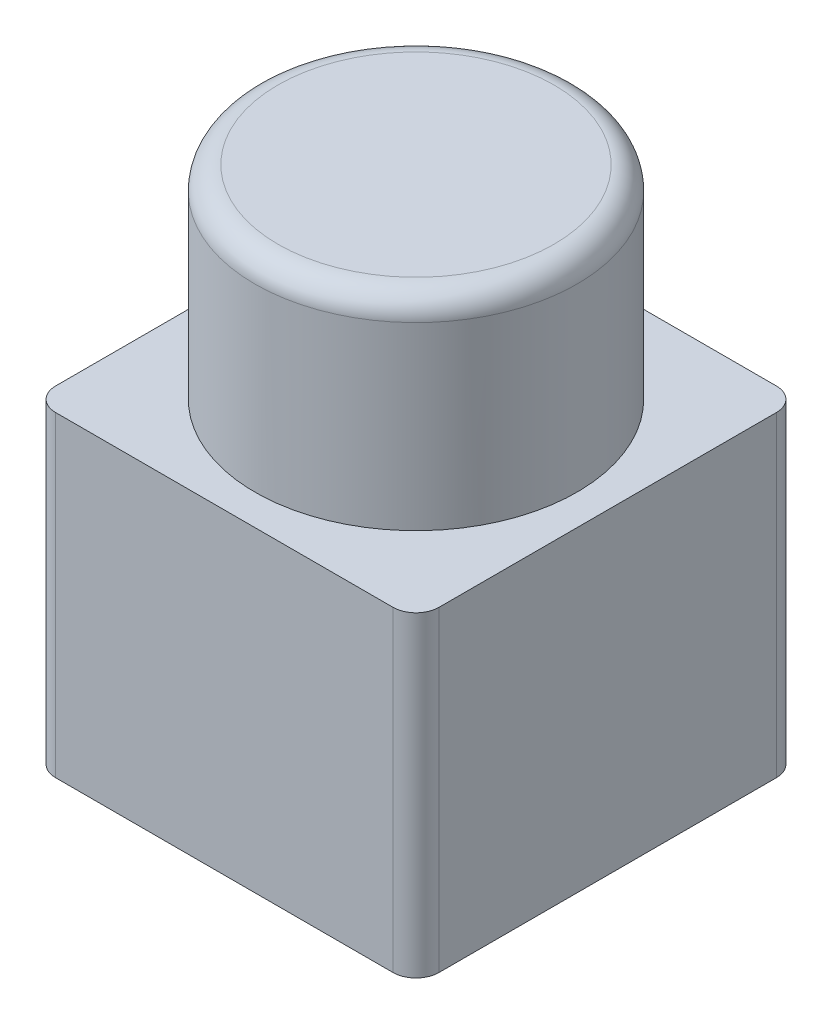
ISO-10303-21;
HEADER;
FILE_DESCRIPTION(('STEP AP214'),'2;1');
FILE_NAME('part.step','',(''),(''),'','','');
FILE_SCHEMA(('AUTOMOTIVE_DESIGN { 1 0 10303 214 1 1 1 1 }'));
ENDSEC;
DATA;
#1=APPLICATION_CONTEXT('core data for automotive mechanical design processes');
#2=APPLICATION_PROTOCOL_DEFINITION('international standard','automotive_design',2000,#1);
#3=PRODUCT_CONTEXT('',#1,'mechanical');
#4=PRODUCT('Part','Part','',(#3));
#5=PRODUCT_RELATED_PRODUCT_CATEGORY('part','',(#4));
#6=PRODUCT_DEFINITION_FORMATION('','',#4);
#7=PRODUCT_DEFINITION_CONTEXT('part definition',#1,'design');
#8=PRODUCT_DEFINITION('design','',#6,#7);
#9=PRODUCT_DEFINITION_SHAPE('','',#8);
#10=(LENGTH_UNIT() NAMED_UNIT(*) SI_UNIT(.MILLI.,.METRE.));
#11=(NAMED_UNIT(*) PLANE_ANGLE_UNIT() SI_UNIT($,.RADIAN.));
#12=(NAMED_UNIT(*) SI_UNIT($,.STERADIAN.) SOLID_ANGLE_UNIT());
#13=UNCERTAINTY_MEASURE_WITH_UNIT(LENGTH_MEASURE(1.E-05),#10,'distance_accuracy_value','');
#14=(GEOMETRIC_REPRESENTATION_CONTEXT(3) GLOBAL_UNCERTAINTY_ASSIGNED_CONTEXT((#13)) GLOBAL_UNIT_ASSIGNED_CONTEXT((#10,
#11,#12)) REPRESENTATION_CONTEXT('',''));
#15=CARTESIAN_POINT('',(0.,0.,0.));
#16=DIRECTION('',(0.,0.,1.));
#17=DIRECTION('',(1.,0.,0.));
#18=AXIS2_PLACEMENT_3D('',#15,#16,#17);
#19=CARTESIAN_POINT('',(0.,41.25,0.));
#20=DIRECTION('',(0.,-1.,0.));
#21=DIRECTION('',(0.,0.,-1.));
#22=AXIS2_PLACEMENT_3D('',#19,#20,#21);
#23=PLANE('',#22);
#24=DIRECTION('',(0.,0.,-1.));
#25=VECTOR('',#24,1.);
#26=CARTESIAN_POINT('',(50.,41.25,0.));
#27=LINE('',#26,#25);
#28=CARTESIAN_POINT('',(50.,41.25,-3.));
#29=VERTEX_POINT('',#28);
#30=CARTESIAN_POINT('',(50.,41.25,-47.));
#31=VERTEX_POINT('',#30);
#32=EDGE_CURVE('E299',#29,#31,#27,.T.);
#33=ORIENTED_EDGE('',*,*,#32,.T.);
#34=CARTESIAN_POINT('',(47.,41.25,-47.));
#35=DIRECTION('',(0.,-1.,0.));
#36=DIRECTION('',(0.,0.,-1.));
#37=AXIS2_PLACEMENT_3D('',#34,#35,#36);
#38=CIRCLE('',#37,3.);
#39=CARTESIAN_POINT('',(47.,41.25,-50.));
#40=VERTEX_POINT('',#39);
#41=EDGE_CURVE('E145',#31,#40,#38,.F.);
#42=ORIENTED_EDGE('',*,*,#41,.T.);
#43=DIRECTION('',(1.,0.,0.));
#44=VECTOR('',#43,1.);
#45=CARTESIAN_POINT('',(0.,41.25,-50.));
#46=LINE('',#45,#44);
#47=CARTESIAN_POINT('',(3.,41.25,-50.));
#48=VERTEX_POINT('',#47);
#49=EDGE_CURVE('E161',#48,#40,#46,.T.);
#50=ORIENTED_EDGE('',*,*,#49,.F.);
#51=CARTESIAN_POINT('',(3.,41.25,-47.));
#52=DIRECTION('',(0.,-1.,0.));
#53=DIRECTION('',(0.,0.,-1.));
#54=AXIS2_PLACEMENT_3D('',#51,#52,#53);
#55=CIRCLE('',#54,3.);
#56=CARTESIAN_POINT('',(0.,41.25,-47.));
#57=VERTEX_POINT('',#56);
#58=EDGE_CURVE('E123',#48,#57,#55,.F.);
#59=ORIENTED_EDGE('',*,*,#58,.T.);
#60=DIRECTION('',(0.,0.,-1.));
#61=VECTOR('',#60,1.);
#62=CARTESIAN_POINT('',(0.,41.25,0.));
#63=LINE('',#62,#61);
#64=CARTESIAN_POINT('',(0.,41.25,-3.));
#65=VERTEX_POINT('',#64);
#66=EDGE_CURVE('E158',#65,#57,#63,.T.);
#67=ORIENTED_EDGE('',*,*,#66,.F.);
#68=CARTESIAN_POINT('',(3.,41.25,-3.));
#69=DIRECTION('',(0.,-1.,0.));
#70=DIRECTION('',(0.,0.,-1.));
#71=AXIS2_PLACEMENT_3D('',#68,#69,#70);
#72=CIRCLE('',#71,3.);
#73=CARTESIAN_POINT('',(3.,41.25,0.));
#74=VERTEX_POINT('',#73);
#75=EDGE_CURVE('E53',#65,#74,#72,.F.);
#76=ORIENTED_EDGE('',*,*,#75,.T.);
#77=DIRECTION('',(1.,0.,0.));
#78=VECTOR('',#77,1.);
#79=CARTESIAN_POINT('',(0.,41.25,0.));
#80=LINE('',#79,#78);
#81=CARTESIAN_POINT('',(47.,41.25,0.));
#82=VERTEX_POINT('',#81);
#83=EDGE_CURVE('E155',#74,#82,#80,.T.);
#84=ORIENTED_EDGE('',*,*,#83,.T.);
#85=CARTESIAN_POINT('',(47.,41.25,-3.));
#86=DIRECTION('',(0.,-1.,0.));
#87=DIRECTION('',(0.,0.,-1.));
#88=AXIS2_PLACEMENT_3D('',#85,#86,#87);
#89=CIRCLE('',#88,3.);
#90=EDGE_CURVE('E142',#82,#29,#89,.F.);
#91=ORIENTED_EDGE('',*,*,#90,.T.);
#92=EDGE_LOOP('',(#33,#42,#50,#59,#67,#76,#84,#91));
#93=FACE_BOUND('',#92,.T.);
#94=CARTESIAN_POINT('',(25.,41.25,-25.));
#95=DIRECTION('',(0.,-1.,0.));
#96=DIRECTION('',(0.,0.,-1.));
#97=AXIS2_PLACEMENT_3D('',#94,#95,#96);
#98=CIRCLE('',#97,21.);
#99=CARTESIAN_POINT('',(25.,41.25,-46.));
#100=VERTEX_POINT('',#99);
#101=EDGE_CURVE('E166',#100,#100,#98,.F.);
#102=ORIENTED_EDGE('',*,*,#101,.F.);
#103=EDGE_LOOP('',(#102));
#104=FACE_BOUND('',#103,.T.);
#105=ADVANCED_FACE('F33',(#93,#104),#23,.F.);
#106=CARTESIAN_POINT('',(0.,41.25,0.));
#107=DIRECTION('',(-1.,0.,0.));
#108=DIRECTION('',(0.,0.,1.));
#109=AXIS2_PLACEMENT_3D('',#106,#107,#108);
#110=PLANE('',#109);
#111=ORIENTED_EDGE('',*,*,#66,.T.);
#112=DIRECTION('',(0.,-1.,0.));
#113=VECTOR('',#112,1.);
#114=CARTESIAN_POINT('',(0.,41.25,-47.));
#115=LINE('',#114,#113);
#116=CARTESIAN_POINT('',(0.,0.,-47.));
#117=VERTEX_POINT('',#116);
#118=EDGE_CURVE('E149',#57,#117,#115,.T.);
#119=ORIENTED_EDGE('',*,*,#118,.T.);
#120=DIRECTION('',(0.,0.,-1.));
#121=VECTOR('',#120,1.);
#122=CARTESIAN_POINT('',(0.,0.,0.));
#123=LINE('',#122,#121);
#124=CARTESIAN_POINT('',(0.,0.,-3.));
#125=VERTEX_POINT('',#124);
#126=EDGE_CURVE('E103',#125,#117,#123,.T.);
#127=ORIENTED_EDGE('',*,*,#126,.F.);
#128=DIRECTION('',(0.,-1.,0.));
#129=VECTOR('',#128,1.);
#130=CARTESIAN_POINT('',(0.,41.25,-3.));
#131=LINE('',#130,#129);
#132=EDGE_CURVE('E147',#125,#65,#131,.F.);
#133=ORIENTED_EDGE('',*,*,#132,.T.);
#134=EDGE_LOOP('',(#111,#119,#127,#133));
#135=FACE_BOUND('',#134,.T.);
#136=ADVANCED_FACE('F189',(#135),#110,.T.);
#137=CARTESIAN_POINT('',(0.,41.25,0.));
#138=DIRECTION('',(0.,0.,-1.));
#139=DIRECTION('',(-1.,0.,0.));
#140=AXIS2_PLACEMENT_3D('',#137,#138,#139);
#141=PLANE('',#140);
#142=DIRECTION('',(1.,0.,0.));
#143=VECTOR('',#142,1.);
#144=CARTESIAN_POINT('',(0.,0.,0.));
#145=LINE('',#144,#143);
#146=CARTESIAN_POINT('',(3.,0.,0.));
#147=VERTEX_POINT('',#146);
#148=CARTESIAN_POINT('',(47.,0.,0.));
#149=VERTEX_POINT('',#148);
#150=EDGE_CURVE('E154',#147,#149,#145,.T.);
#151=ORIENTED_EDGE('',*,*,#150,.T.);
#152=DIRECTION('',(0.,-1.,0.));
#153=VECTOR('',#152,1.);
#154=CARTESIAN_POINT('',(47.,41.25,0.));
#155=LINE('',#154,#153);
#156=EDGE_CURVE('E11',#149,#82,#155,.F.);
#157=ORIENTED_EDGE('',*,*,#156,.T.);
#158=ORIENTED_EDGE('',*,*,#83,.F.);
#159=DIRECTION('',(0.,-1.,0.));
#160=VECTOR('',#159,1.);
#161=CARTESIAN_POINT('',(3.,0.,0.));
#162=LINE('',#161,#160);
#163=EDGE_CURVE('E41',#74,#147,#162,.T.);
#164=ORIENTED_EDGE('',*,*,#163,.T.);
#165=EDGE_LOOP('',(#151,#157,#158,#164));
#166=FACE_BOUND('',#165,.T.);
#167=ADVANCED_FACE('F153',(#166),#141,.F.);
#168=CARTESIAN_POINT('',(50.,41.25,0.));
#169=DIRECTION('',(-1.,0.,0.));
#170=DIRECTION('',(0.,0.,1.));
#171=AXIS2_PLACEMENT_3D('',#168,#169,#170);
#172=PLANE('',#171);
#173=DIRECTION('',(0.,0.,-1.));
#174=VECTOR('',#173,1.);
#175=CARTESIAN_POINT('',(50.,0.,0.));
#176=LINE('',#175,#174);
#177=CARTESIAN_POINT('',(50.,0.,-3.));
#178=VERTEX_POINT('',#177);
#179=CARTESIAN_POINT('',(50.,0.,-47.));
#180=VERTEX_POINT('',#179);
#181=EDGE_CURVE('E119',#178,#180,#176,.T.);
#182=ORIENTED_EDGE('',*,*,#181,.T.);
#183=DIRECTION('',(0.,-1.,0.));
#184=VECTOR('',#183,1.);
#185=CARTESIAN_POINT('',(50.,41.25,-47.));
#186=LINE('',#185,#184);
#187=EDGE_CURVE('E139',#180,#31,#186,.F.);
#188=ORIENTED_EDGE('',*,*,#187,.T.);
#189=ORIENTED_EDGE('',*,*,#32,.F.);
#190=DIRECTION('',(0.,-1.,0.));
#191=VECTOR('',#190,1.);
#192=CARTESIAN_POINT('',(50.,41.25,-3.));
#193=LINE('',#192,#191);
#194=EDGE_CURVE('E136',#29,#178,#193,.T.);
#195=ORIENTED_EDGE('',*,*,#194,.T.);
#196=EDGE_LOOP('',(#182,#188,#189,#195));
#197=FACE_BOUND('',#196,.T.);
#198=ADVANCED_FACE('F206',(#197),#172,.F.);
#199=CARTESIAN_POINT('',(0.,41.25,-50.));
#200=DIRECTION('',(0.,0.,-1.));
#201=DIRECTION('',(-1.,0.,0.));
#202=AXIS2_PLACEMENT_3D('',#199,#200,#201);
#203=PLANE('',#202);
#204=ORIENTED_EDGE('',*,*,#49,.T.);
#205=DIRECTION('',(0.,-1.,0.));
#206=VECTOR('',#205,1.);
#207=CARTESIAN_POINT('',(47.,0.,-50.));
#208=LINE('',#207,#206);
#209=CARTESIAN_POINT('',(47.,0.,-50.));
#210=VERTEX_POINT('',#209);
#211=EDGE_CURVE('E118',#40,#210,#208,.T.);
#212=ORIENTED_EDGE('',*,*,#211,.T.);
#213=DIRECTION('',(1.,0.,0.));
#214=VECTOR('',#213,1.);
#215=CARTESIAN_POINT('',(0.,0.,-50.));
#216=LINE('',#215,#214);
#217=CARTESIAN_POINT('',(3.,0.,-50.));
#218=VERTEX_POINT('',#217);
#219=EDGE_CURVE('E101',#218,#210,#216,.T.);
#220=ORIENTED_EDGE('',*,*,#219,.F.);
#221=DIRECTION('',(0.,-1.,0.));
#222=VECTOR('',#221,1.);
#223=CARTESIAN_POINT('',(3.,41.25,-50.));
#224=LINE('',#223,#222);
#225=EDGE_CURVE('E115',#218,#48,#224,.F.);
#226=ORIENTED_EDGE('',*,*,#225,.T.);
#227=EDGE_LOOP('',(#204,#212,#220,#226));
#228=FACE_BOUND('',#227,.T.);
#229=ADVANCED_FACE('F114',(#228),#203,.T.);
#230=CARTESIAN_POINT('',(0.,0.,0.));
#231=DIRECTION('',(0.,-1.,0.));
#232=DIRECTION('',(0.,0.,-1.));
#233=AXIS2_PLACEMENT_3D('',#230,#231,#232);
#234=PLANE('',#233);
#235=CARTESIAN_POINT('',(5.00000000000001,0.,-5.00000000000008));
#236=DIRECTION('',(0.,-1.,0.));
#237=DIRECTION('',(0.,0.,-1.));
#238=AXIS2_PLACEMENT_3D('',#235,#236,#237);
#239=CIRCLE('',#238,1.5);
#240=CARTESIAN_POINT('',(5.00000000000001,0.,-6.50000000000008));
#241=VERTEX_POINT('',#240);
#242=EDGE_CURVE('E311',#241,#241,#239,.T.);
#243=ORIENTED_EDGE('',*,*,#242,.F.);
#244=EDGE_LOOP('',(#243));
#245=FACE_BOUND('',#244,.T.);
#246=CARTESIAN_POINT('',(45.,0.,-44.9999999999999));
#247=DIRECTION('',(0.,-1.,0.));
#248=DIRECTION('',(0.,0.,-1.));
#249=AXIS2_PLACEMENT_3D('',#246,#247,#248);
#250=CIRCLE('',#249,1.5);
#251=CARTESIAN_POINT('',(45.,0.,-46.4999999999999));
#252=VERTEX_POINT('',#251);
#253=EDGE_CURVE('E307',#252,#252,#250,.T.);
#254=ORIENTED_EDGE('',*,*,#253,.F.);
#255=EDGE_LOOP('',(#254));
#256=FACE_BOUND('',#255,.T.);
#257=ORIENTED_EDGE('',*,*,#219,.T.);
#258=CARTESIAN_POINT('',(47.,0.,-47.));
#259=DIRECTION('',(0.,-1.,0.));
#260=DIRECTION('',(0.,0.,-1.));
#261=AXIS2_PLACEMENT_3D('',#258,#259,#260);
#262=CIRCLE('',#261,3.);
#263=EDGE_CURVE('E108',#210,#180,#262,.T.);
#264=ORIENTED_EDGE('',*,*,#263,.T.);
#265=ORIENTED_EDGE('',*,*,#181,.F.);
#266=CARTESIAN_POINT('',(47.,0.,-3.));
#267=DIRECTION('',(0.,-1.,0.));
#268=DIRECTION('',(0.,0.,-1.));
#269=AXIS2_PLACEMENT_3D('',#266,#267,#268);
#270=CIRCLE('',#269,3.);
#271=EDGE_CURVE('E109',#178,#149,#270,.T.);
#272=ORIENTED_EDGE('',*,*,#271,.T.);
#273=ORIENTED_EDGE('',*,*,#150,.F.);
#274=CARTESIAN_POINT('',(3.,0.,-3.));
#275=DIRECTION('',(0.,-1.,0.));
#276=DIRECTION('',(0.,0.,-1.));
#277=AXIS2_PLACEMENT_3D('',#274,#275,#276);
#278=CIRCLE('',#277,3.);
#279=EDGE_CURVE('E126',#147,#125,#278,.T.);
#280=ORIENTED_EDGE('',*,*,#279,.T.);
#281=ORIENTED_EDGE('',*,*,#126,.T.);
#282=CARTESIAN_POINT('',(3.,0.,-47.));
#283=DIRECTION('',(0.,-1.,0.));
#284=DIRECTION('',(0.,0.,-1.));
#285=AXIS2_PLACEMENT_3D('',#282,#283,#284);
#286=CIRCLE('',#285,3.);
#287=EDGE_CURVE('E98',#117,#218,#286,.T.);
#288=ORIENTED_EDGE('',*,*,#287,.T.);
#289=EDGE_LOOP('',(#257,#264,#265,#272,#273,#280,#281,#288));
#290=FACE_BOUND('',#289,.T.);
#291=ADVANCED_FACE('F100',(#245,#256,#290),#234,.T.);
#292=CARTESIAN_POINT('',(45.,6.,-44.9999999999999));
#293=DIRECTION('',(0.,-1.,0.));
#294=DIRECTION('',(0.,0.,-1.));
#295=AXIS2_PLACEMENT_3D('',#292,#293,#294);
#296=CYLINDRICAL_SURFACE('',#295,1.5);
#297=CARTESIAN_POINT('',(45.,6.,-44.9999999999999));
#298=DIRECTION('',(0.,-1.,0.));
#299=DIRECTION('',(0.,0.,-1.));
#300=AXIS2_PLACEMENT_3D('',#297,#298,#299);
#301=CIRCLE('',#300,1.5);
#302=CARTESIAN_POINT('',(45.,6.,-46.4999999999999));
#303=VERTEX_POINT('',#302);
#304=EDGE_CURVE('E305',#303,#303,#301,.T.);
#305=ORIENTED_EDGE('',*,*,#304,.F.);
#306=EDGE_LOOP('',(#305));
#307=FACE_BOUND('',#306,.T.);
#308=ORIENTED_EDGE('',*,*,#253,.T.);
#309=EDGE_LOOP('',(#308));
#310=FACE_BOUND('',#309,.T.);
#311=ADVANCED_FACE('F199',(#307,#310),#296,.F.);
#312=CARTESIAN_POINT('',(45.,6.,-44.9999999999999));
#313=DIRECTION('',(0.,-1.,0.));
#314=DIRECTION('',(0.,0.,-1.));
#315=AXIS2_PLACEMENT_3D('',#312,#313,#314);
#316=PLANE('',#315);
#317=ORIENTED_EDGE('',*,*,#304,.T.);
#318=EDGE_LOOP('',(#317));
#319=FACE_BOUND('',#318,.T.);
#320=ADVANCED_FACE('F226',(#319),#316,.T.);
#321=CARTESIAN_POINT('',(5.00000000000001,6.,-5.00000000000008));
#322=DIRECTION('',(0.,-1.,0.));
#323=DIRECTION('',(0.,0.,-1.));
#324=AXIS2_PLACEMENT_3D('',#321,#322,#323);
#325=CYLINDRICAL_SURFACE('',#324,1.5);
#326=CARTESIAN_POINT('',(5.00000000000001,6.,-5.00000000000008));
#327=DIRECTION('',(0.,-1.,0.));
#328=DIRECTION('',(0.,0.,-1.));
#329=AXIS2_PLACEMENT_3D('',#326,#327,#328);
#330=CIRCLE('',#329,1.5);
#331=CARTESIAN_POINT('',(5.00000000000001,6.,-6.50000000000008));
#332=VERTEX_POINT('',#331);
#333=EDGE_CURVE('E313',#332,#332,#330,.T.);
#334=ORIENTED_EDGE('',*,*,#333,.F.);
#335=EDGE_LOOP('',(#334));
#336=FACE_BOUND('',#335,.T.);
#337=ORIENTED_EDGE('',*,*,#242,.T.);
#338=EDGE_LOOP('',(#337));
#339=FACE_BOUND('',#338,.T.);
#340=ADVANCED_FACE('F233',(#336,#339),#325,.F.);
#341=CARTESIAN_POINT('',(5.00000000000001,6.,-5.00000000000008));
#342=DIRECTION('',(0.,-1.,0.));
#343=DIRECTION('',(0.,0.,-1.));
#344=AXIS2_PLACEMENT_3D('',#341,#342,#343);
#345=PLANE('',#344);
#346=ORIENTED_EDGE('',*,*,#333,.T.);
#347=EDGE_LOOP('',(#346));
#348=FACE_BOUND('',#347,.T.);
#349=ADVANCED_FACE('F240',(#348),#345,.T.);
#350=CARTESIAN_POINT('',(25.,67.75,-25.));
#351=DIRECTION('',(0.,-1.,0.));
#352=DIRECTION('',(0.,0.,-1.));
#353=AXIS2_PLACEMENT_3D('',#350,#351,#352);
#354=CYLINDRICAL_SURFACE('',#353,21.);
#355=CARTESIAN_POINT('',(25.,64.75,-25.));
#356=DIRECTION('',(0.,1.,0.));
#357=DIRECTION('',(0.,0.,1.));
#358=AXIS2_PLACEMENT_3D('',#355,#356,#357);
#359=CIRCLE('',#358,21.);
#360=CARTESIAN_POINT('',(25.,64.75,-4.));
#361=VERTEX_POINT('',#360);
#362=EDGE_CURVE('E124',#361,#361,#359,.F.);
#363=ORIENTED_EDGE('',*,*,#362,.T.);
#364=EDGE_LOOP('',(#363));
#365=FACE_BOUND('',#364,.T.);
#366=ORIENTED_EDGE('',*,*,#101,.T.);
#367=EDGE_LOOP('',(#366));
#368=FACE_BOUND('',#367,.T.);
#369=ADVANCED_FACE('F184',(#365,#368),#354,.T.);
#370=CARTESIAN_POINT('',(25.,67.75,-25.));
#371=DIRECTION('',(0.,1.,0.));
#372=DIRECTION('',(0.,0.,1.));
#373=AXIS2_PLACEMENT_3D('',#370,#371,#372);
#374=PLANE('',#373);
#375=CARTESIAN_POINT('',(25.,67.75,-25.));
#376=DIRECTION('',(0.,1.,0.));
#377=DIRECTION('',(0.,0.,1.));
#378=AXIS2_PLACEMENT_3D('',#375,#376,#377);
#379=CIRCLE('',#378,18.);
#380=CARTESIAN_POINT('',(25.,67.75,-7.));
#381=VERTEX_POINT('',#380);
#382=EDGE_CURVE('E129',#381,#381,#379,.T.);
#383=ORIENTED_EDGE('',*,*,#382,.T.);
#384=EDGE_LOOP('',(#383));
#385=FACE_BOUND('',#384,.T.);
#386=ADVANCED_FACE('F171',(#385),#374,.T.);
#387=CARTESIAN_POINT('',(25.,64.75,-25.));
#388=DIRECTION('',(0.,1.,0.));
#389=DIRECTION('',(0.,0.,1.));
#390=AXIS2_PLACEMENT_3D('',#387,#388,#389);
#391=TOROIDAL_SURFACE('',#390,18.,3.);
#392=ORIENTED_EDGE('',*,*,#362,.F.);
#393=EDGE_LOOP('',(#392));
#394=FACE_BOUND('',#393,.T.);
#395=ORIENTED_EDGE('',*,*,#382,.F.);
#396=EDGE_LOOP('',(#395));
#397=FACE_BOUND('',#396,.T.);
#398=ADVANCED_FACE('F173',(#394,#397),#391,.T.);
#399=CARTESIAN_POINT('',(47.,41.25,-47.));
#400=DIRECTION('',(0.,1.,0.));
#401=DIRECTION('',(0.,0.,1.));
#402=AXIS2_PLACEMENT_3D('',#399,#400,#401);
#403=CYLINDRICAL_SURFACE('',#402,3.);
#404=ORIENTED_EDGE('',*,*,#41,.F.);
#405=ORIENTED_EDGE('',*,*,#187,.F.);
#406=ORIENTED_EDGE('',*,*,#263,.F.);
#407=ORIENTED_EDGE('',*,*,#211,.F.);
#408=EDGE_LOOP('',(#404,#405,#406,#407));
#409=FACE_BOUND('',#408,.T.);
#410=ADVANCED_FACE('F175',(#409),#403,.T.);
#411=CARTESIAN_POINT('',(3.,41.25,-47.));
#412=DIRECTION('',(0.,-1.,0.));
#413=DIRECTION('',(0.,0.,-1.));
#414=AXIS2_PLACEMENT_3D('',#411,#412,#413);
#415=CYLINDRICAL_SURFACE('',#414,3.);
#416=ORIENTED_EDGE('',*,*,#58,.F.);
#417=ORIENTED_EDGE('',*,*,#225,.F.);
#418=ORIENTED_EDGE('',*,*,#287,.F.);
#419=ORIENTED_EDGE('',*,*,#118,.F.);
#420=EDGE_LOOP('',(#416,#417,#418,#419));
#421=FACE_BOUND('',#420,.T.);
#422=ADVANCED_FACE('F122',(#421),#415,.T.);
#423=CARTESIAN_POINT('',(47.,41.25,-3.));
#424=DIRECTION('',(0.,-1.,0.));
#425=DIRECTION('',(0.,0.,-1.));
#426=AXIS2_PLACEMENT_3D('',#423,#424,#425);
#427=CYLINDRICAL_SURFACE('',#426,3.);
#428=ORIENTED_EDGE('',*,*,#90,.F.);
#429=ORIENTED_EDGE('',*,*,#156,.F.);
#430=ORIENTED_EDGE('',*,*,#271,.F.);
#431=ORIENTED_EDGE('',*,*,#194,.F.);
#432=EDGE_LOOP('',(#428,#429,#430,#431));
#433=FACE_BOUND('',#432,.T.);
#434=ADVANCED_FACE('F278',(#433),#427,.T.);
#435=CARTESIAN_POINT('',(3.,41.25,-3.));
#436=DIRECTION('',(0.,1.,0.));
#437=DIRECTION('',(0.,0.,1.));
#438=AXIS2_PLACEMENT_3D('',#435,#436,#437);
#439=CYLINDRICAL_SURFACE('',#438,3.);
#440=ORIENTED_EDGE('',*,*,#75,.F.);
#441=ORIENTED_EDGE('',*,*,#132,.F.);
#442=ORIENTED_EDGE('',*,*,#279,.F.);
#443=ORIENTED_EDGE('',*,*,#163,.F.);
#444=EDGE_LOOP('',(#440,#441,#442,#443));
#445=FACE_BOUND('',#444,.T.);
#446=ADVANCED_FACE('F35',(#445),#439,.T.);
#447=CLOSED_SHELL('',(#105,#136,#167,#198,#229,#291,#311,#320,#340,#349,#369,#386,#398,#410,
#422,#434,#446));
#448=MANIFOLD_SOLID_BREP('B2',#447);
#449=ADVANCED_BREP_SHAPE_REPRESENTATION('',(#18,#448),#14);
#450=SHAPE_DEFINITION_REPRESENTATION(#9,#449);
ENDSEC;
END-ISO-10303-21;
